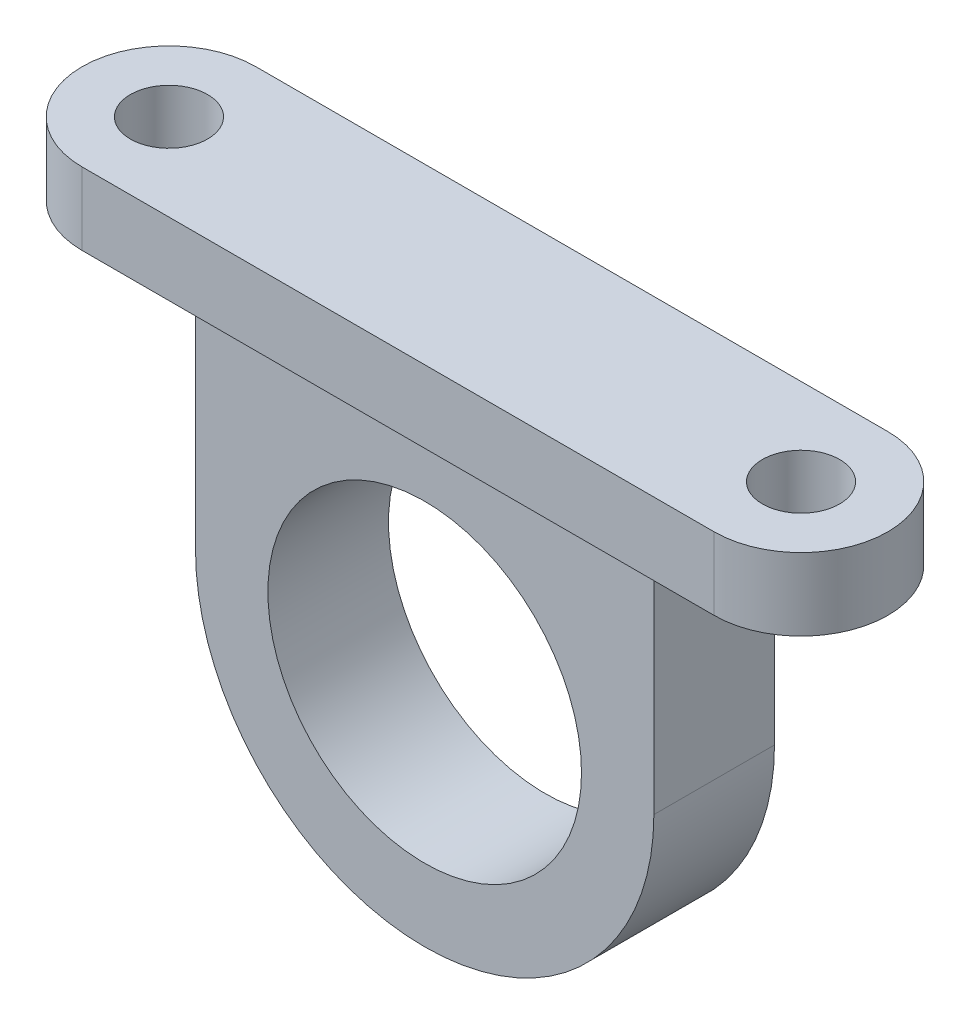
ISO-10303-21;
HEADER;
FILE_DESCRIPTION(('STEP AP214'),'2;1');
FILE_NAME('part.step','',(''),(''),'','','');
FILE_SCHEMA(('AUTOMOTIVE_DESIGN { 1 0 10303 214 1 1 1 1 }'));
ENDSEC;
DATA;
#1=APPLICATION_CONTEXT('core data for automotive mechanical design processes');
#2=APPLICATION_PROTOCOL_DEFINITION('international standard','automotive_design',2000,#1);
#3=PRODUCT_CONTEXT('',#1,'mechanical');
#4=PRODUCT('Part','Part','',(#3));
#5=PRODUCT_RELATED_PRODUCT_CATEGORY('part','',(#4));
#6=PRODUCT_DEFINITION_FORMATION('','',#4);
#7=PRODUCT_DEFINITION_CONTEXT('part definition',#1,'design');
#8=PRODUCT_DEFINITION('design','',#6,#7);
#9=PRODUCT_DEFINITION_SHAPE('','',#8);
#10=(LENGTH_UNIT() NAMED_UNIT(*) SI_UNIT(.MILLI.,.METRE.));
#11=(NAMED_UNIT(*) PLANE_ANGLE_UNIT() SI_UNIT($,.RADIAN.));
#12=(NAMED_UNIT(*) SI_UNIT($,.STERADIAN.) SOLID_ANGLE_UNIT());
#13=UNCERTAINTY_MEASURE_WITH_UNIT(LENGTH_MEASURE(1.E-05),#10,'distance_accuracy_value','');
#14=(GEOMETRIC_REPRESENTATION_CONTEXT(3) GLOBAL_UNCERTAINTY_ASSIGNED_CONTEXT((#13)) GLOBAL_UNIT_ASSIGNED_CONTEXT((#10,
#11,#12)) REPRESENTATION_CONTEXT('',''));
#15=CARTESIAN_POINT('',(0.,0.,0.));
#16=DIRECTION('',(0.,0.,1.));
#17=DIRECTION('',(1.,0.,0.));
#18=AXIS2_PLACEMENT_3D('',#15,#16,#17);
#19=CARTESIAN_POINT('',(0.,0.,5.));
#20=DIRECTION('',(0.,0.,1.));
#21=DIRECTION('',(1.,0.,0.));
#22=AXIS2_PLACEMENT_3D('',#19,#20,#21);
#23=PLANE('',#22);
#24=DIRECTION('',(-1.,0.,0.));
#25=VECTOR('',#24,1.);
#26=CARTESIAN_POINT('',(-9.5,9.5,5.));
#27=LINE('',#26,#25);
#28=CARTESIAN_POINT('',(9.5,9.5,5.));
#29=VERTEX_POINT('',#28);
#30=CARTESIAN_POINT('',(-9.5,9.5,5.));
#31=VERTEX_POINT('',#30);
#32=EDGE_CURVE('E201',#29,#31,#27,.T.);
#33=ORIENTED_EDGE('',*,*,#32,.T.);
#34=DIRECTION('',(0.,-1.,0.));
#35=VECTOR('',#34,1.);
#36=CARTESIAN_POINT('',(-9.5,0.,5.));
#37=LINE('',#36,#35);
#38=CARTESIAN_POINT('',(-9.5,0.,5.));
#39=VERTEX_POINT('',#38);
#40=EDGE_CURVE('E90',#31,#39,#37,.T.);
#41=ORIENTED_EDGE('',*,*,#40,.T.);
#42=CARTESIAN_POINT('',(0.,0.,5.));
#43=DIRECTION('',(0.,0.,1.));
#44=DIRECTION('',(1.,0.,0.));
#45=AXIS2_PLACEMENT_3D('',#42,#43,#44);
#46=CIRCLE('',#45,9.5);
#47=CARTESIAN_POINT('',(9.5,0.,5.));
#48=VERTEX_POINT('',#47);
#49=EDGE_CURVE('E207',#39,#48,#46,.T.);
#50=ORIENTED_EDGE('',*,*,#49,.T.);
#51=DIRECTION('',(0.,1.,0.));
#52=VECTOR('',#51,1.);
#53=CARTESIAN_POINT('',(9.5,0.,5.));
#54=LINE('',#53,#52);
#55=EDGE_CURVE('E65',#48,#29,#54,.T.);
#56=ORIENTED_EDGE('',*,*,#55,.T.);
#57=EDGE_LOOP('',(#33,#41,#50,#56));
#58=FACE_BOUND('',#57,.T.);
#59=CARTESIAN_POINT('',(0.,0.,5.));
#60=DIRECTION('',(0.,0.,1.));
#61=DIRECTION('',(1.,0.,0.));
#62=AXIS2_PLACEMENT_3D('',#59,#60,#61);
#63=CIRCLE('',#62,6.5);
#64=CARTESIAN_POINT('',(6.5,0.,5.));
#65=VERTEX_POINT('',#64);
#66=EDGE_CURVE('E193',#65,#65,#63,.T.);
#67=ORIENTED_EDGE('',*,*,#66,.F.);
#68=EDGE_LOOP('',(#67));
#69=FACE_BOUND('',#68,.T.);
#70=ADVANCED_FACE('F47',(#58,#69),#23,.T.);
#71=CARTESIAN_POINT('',(0.,0.,0.));
#72=DIRECTION('',(0.,0.,1.));
#73=DIRECTION('',(1.,0.,0.));
#74=AXIS2_PLACEMENT_3D('',#71,#72,#73);
#75=PLANE('',#74);
#76=DIRECTION('',(-1.,0.,0.));
#77=VECTOR('',#76,1.);
#78=CARTESIAN_POINT('',(-9.5,9.5,0.));
#79=LINE('',#78,#77);
#80=CARTESIAN_POINT('',(9.5,9.5,0.));
#81=VERTEX_POINT('',#80);
#82=CARTESIAN_POINT('',(-9.5,9.5,0.));
#83=VERTEX_POINT('',#82);
#84=EDGE_CURVE('E197',#81,#83,#79,.T.);
#85=ORIENTED_EDGE('',*,*,#84,.F.);
#86=DIRECTION('',(0.,1.,0.));
#87=VECTOR('',#86,1.);
#88=CARTESIAN_POINT('',(9.5,0.,0.));
#89=LINE('',#88,#87);
#90=CARTESIAN_POINT('',(9.5,0.,0.));
#91=VERTEX_POINT('',#90);
#92=EDGE_CURVE('E204',#91,#81,#89,.T.);
#93=ORIENTED_EDGE('',*,*,#92,.F.);
#94=CARTESIAN_POINT('',(0.,0.,0.));
#95=DIRECTION('',(0.,0.,1.));
#96=DIRECTION('',(1.,0.,0.));
#97=AXIS2_PLACEMENT_3D('',#94,#95,#96);
#98=CIRCLE('',#97,9.5);
#99=CARTESIAN_POINT('',(-9.5,0.,0.));
#100=VERTEX_POINT('',#99);
#101=EDGE_CURVE('E85',#100,#91,#98,.T.);
#102=ORIENTED_EDGE('',*,*,#101,.F.);
#103=DIRECTION('',(0.,-1.,0.));
#104=VECTOR('',#103,1.);
#105=CARTESIAN_POINT('',(-9.5,0.,0.));
#106=LINE('',#105,#104);
#107=EDGE_CURVE('E78',#83,#100,#106,.T.);
#108=ORIENTED_EDGE('',*,*,#107,.F.);
#109=EDGE_LOOP('',(#85,#93,#102,#108));
#110=FACE_BOUND('',#109,.T.);
#111=CARTESIAN_POINT('',(0.,0.,0.));
#112=DIRECTION('',(0.,0.,1.));
#113=DIRECTION('',(1.,0.,0.));
#114=AXIS2_PLACEMENT_3D('',#111,#112,#113);
#115=CIRCLE('',#114,6.5);
#116=CARTESIAN_POINT('',(6.5,0.,0.));
#117=VERTEX_POINT('',#116);
#118=EDGE_CURVE('E131',#117,#117,#115,.T.);
#119=ORIENTED_EDGE('',*,*,#118,.T.);
#120=EDGE_LOOP('',(#119));
#121=FACE_BOUND('',#120,.T.);
#122=ADVANCED_FACE('F233',(#110,#121),#75,.F.);
#123=CARTESIAN_POINT('',(-9.5,0.,5.));
#124=DIRECTION('',(1.,0.,0.));
#125=DIRECTION('',(0.,1.,0.));
#126=AXIS2_PLACEMENT_3D('',#123,#124,#125);
#127=PLANE('',#126);
#128=ORIENTED_EDGE('',*,*,#107,.T.);
#129=DIRECTION('',(0.,0.,-1.));
#130=VECTOR('',#129,1.);
#131=CARTESIAN_POINT('',(-9.5,0.,5.));
#132=LINE('',#131,#130);
#133=EDGE_CURVE('E57',#39,#100,#132,.T.);
#134=ORIENTED_EDGE('',*,*,#133,.F.);
#135=ORIENTED_EDGE('',*,*,#40,.F.);
#136=DIRECTION('',(0.,0.,-1.));
#137=VECTOR('',#136,1.);
#138=CARTESIAN_POINT('',(-9.5,9.5,5.));
#139=LINE('',#138,#137);
#140=EDGE_CURVE('E11',#31,#83,#139,.T.);
#141=ORIENTED_EDGE('',*,*,#140,.T.);
#142=EDGE_LOOP('',(#128,#134,#135,#141));
#143=FACE_BOUND('',#142,.T.);
#144=ADVANCED_FACE('F49',(#143),#127,.F.);
#145=CARTESIAN_POINT('',(0.,0.,5.));
#146=DIRECTION('',(0.,0.,-1.));
#147=DIRECTION('',(-1.,0.,0.));
#148=AXIS2_PLACEMENT_3D('',#145,#146,#147);
#149=CYLINDRICAL_SURFACE('',#148,9.5);
#150=ORIENTED_EDGE('',*,*,#101,.T.);
#151=DIRECTION('',(0.,0.,-1.));
#152=VECTOR('',#151,1.);
#153=CARTESIAN_POINT('',(9.5,0.,5.));
#154=LINE('',#153,#152);
#155=EDGE_CURVE('E226',#48,#91,#154,.T.);
#156=ORIENTED_EDGE('',*,*,#155,.F.);
#157=ORIENTED_EDGE('',*,*,#49,.F.);
#158=ORIENTED_EDGE('',*,*,#133,.T.);
#159=EDGE_LOOP('',(#150,#156,#157,#158));
#160=FACE_BOUND('',#159,.T.);
#161=ADVANCED_FACE('F230',(#160),#149,.T.);
#162=CARTESIAN_POINT('',(9.5,0.,5.));
#163=DIRECTION('',(-1.,0.,0.));
#164=DIRECTION('',(0.,-1.,0.));
#165=AXIS2_PLACEMENT_3D('',#162,#163,#164);
#166=PLANE('',#165);
#167=ORIENTED_EDGE('',*,*,#92,.T.);
#168=DIRECTION('',(0.,0.,-1.));
#169=VECTOR('',#168,1.);
#170=CARTESIAN_POINT('',(9.5,9.5,5.));
#171=LINE('',#170,#169);
#172=EDGE_CURVE('E212',#29,#81,#171,.T.);
#173=ORIENTED_EDGE('',*,*,#172,.F.);
#174=ORIENTED_EDGE('',*,*,#55,.F.);
#175=ORIENTED_EDGE('',*,*,#155,.T.);
#176=EDGE_LOOP('',(#167,#173,#174,#175));
#177=FACE_BOUND('',#176,.T.);
#178=ADVANCED_FACE('F236',(#177),#166,.F.);
#179=CARTESIAN_POINT('',(0.,0.,5.));
#180=DIRECTION('',(0.,0.,-1.));
#181=DIRECTION('',(-1.,0.,0.));
#182=AXIS2_PLACEMENT_3D('',#179,#180,#181);
#183=CYLINDRICAL_SURFACE('',#182,6.5);
#184=ORIENTED_EDGE('',*,*,#66,.T.);
#185=EDGE_LOOP('',(#184));
#186=FACE_BOUND('',#185,.T.);
#187=ORIENTED_EDGE('',*,*,#118,.F.);
#188=EDGE_LOOP('',(#187));
#189=FACE_BOUND('',#188,.T.);
#190=ADVANCED_FACE('F246',(#186,#189),#183,.F.);
#191=CARTESIAN_POINT('',(0.,9.5,0.));
#192=DIRECTION('',(0.,1.,0.));
#193=DIRECTION('',(0.,0.,1.));
#194=AXIS2_PLACEMENT_3D('',#191,#192,#193);
#195=PLANE('',#194);
#196=CARTESIAN_POINT('',(-13.1,9.5,2.5));
#197=DIRECTION('',(0.,1.,0.));
#198=DIRECTION('',(0.,0.,1.));
#199=AXIS2_PLACEMENT_3D('',#196,#197,#198);
#200=CIRCLE('',#199,1.6);
#201=CARTESIAN_POINT('',(-13.1,9.5,4.1));
#202=VERTEX_POINT('',#201);
#203=EDGE_CURVE('E165',#202,#202,#200,.T.);
#204=ORIENTED_EDGE('',*,*,#203,.T.);
#205=EDGE_LOOP('',(#204));
#206=FACE_BOUND('',#205,.T.);
#207=CARTESIAN_POINT('',(13.1,9.5,2.5));
#208=DIRECTION('',(0.,1.,0.));
#209=DIRECTION('',(0.,0.,1.));
#210=AXIS2_PLACEMENT_3D('',#207,#208,#209);
#211=CIRCLE('',#210,3.6);
#212=CARTESIAN_POINT('',(13.1,9.5,-1.1));
#213=VERTEX_POINT('',#212);
#214=CARTESIAN_POINT('',(13.1,9.5,6.1));
#215=VERTEX_POINT('',#214);
#216=EDGE_CURVE('E126',#213,#215,#211,.F.);
#217=ORIENTED_EDGE('',*,*,#216,.T.);
#218=DIRECTION('',(1.,0.,0.));
#219=VECTOR('',#218,1.);
#220=CARTESIAN_POINT('',(0.,9.5,6.1));
#221=LINE('',#220,#219);
#222=CARTESIAN_POINT('',(-13.1,9.5,6.1));
#223=VERTEX_POINT('',#222);
#224=EDGE_CURVE('E178',#223,#215,#221,.T.);
#225=ORIENTED_EDGE('',*,*,#224,.F.);
#226=CARTESIAN_POINT('',(-13.1,9.5,2.5));
#227=DIRECTION('',(0.,1.,0.));
#228=DIRECTION('',(0.,0.,1.));
#229=AXIS2_PLACEMENT_3D('',#226,#227,#228);
#230=CIRCLE('',#229,3.6);
#231=CARTESIAN_POINT('',(-13.1,9.5,-1.1));
#232=VERTEX_POINT('',#231);
#233=EDGE_CURVE('E174',#232,#223,#230,.T.);
#234=ORIENTED_EDGE('',*,*,#233,.F.);
#235=DIRECTION('',(-1.,0.,0.));
#236=VECTOR('',#235,1.);
#237=CARTESIAN_POINT('',(0.,9.5,-1.1));
#238=LINE('',#237,#236);
#239=EDGE_CURVE('E171',#213,#232,#238,.T.);
#240=ORIENTED_EDGE('',*,*,#239,.F.);
#241=EDGE_LOOP('',(#217,#225,#234,#240));
#242=FACE_BOUND('',#241,.T.);
#243=CARTESIAN_POINT('',(13.1,9.5,2.5));
#244=DIRECTION('',(0.,1.,0.));
#245=DIRECTION('',(0.,0.,1.));
#246=AXIS2_PLACEMENT_3D('',#243,#244,#245);
#247=CIRCLE('',#246,1.6);
#248=CARTESIAN_POINT('',(13.1,9.5,4.1));
#249=VERTEX_POINT('',#248);
#250=EDGE_CURVE('E153',#249,#249,#247,.F.);
#251=ORIENTED_EDGE('',*,*,#250,.F.);
#252=EDGE_LOOP('',(#251));
#253=FACE_BOUND('',#252,.T.);
#254=ORIENTED_EDGE('',*,*,#172,.T.);
#255=ORIENTED_EDGE('',*,*,#84,.T.);
#256=ORIENTED_EDGE('',*,*,#140,.F.);
#257=ORIENTED_EDGE('',*,*,#32,.F.);
#258=EDGE_LOOP('',(#254,#255,#256,#257));
#259=FACE_BOUND('',#258,.T.);
#260=ADVANCED_FACE('F239',(#206,#242,#253,#259),#195,.F.);
#261=CARTESIAN_POINT('',(13.1,12.5,2.5));
#262=DIRECTION('',(0.,-1.,0.));
#263=DIRECTION('',(0.,0.,-1.));
#264=AXIS2_PLACEMENT_3D('',#261,#262,#263);
#265=CYLINDRICAL_SURFACE('',#264,3.6);
#266=ORIENTED_EDGE('',*,*,#216,.F.);
#267=DIRECTION('',(0.,-1.,0.));
#268=VECTOR('',#267,1.);
#269=CARTESIAN_POINT('',(13.1,12.5,-1.1));
#270=LINE('',#269,#268);
#271=CARTESIAN_POINT('',(13.1,12.5,-1.1));
#272=VERTEX_POINT('',#271);
#273=EDGE_CURVE('E120',#272,#213,#270,.T.);
#274=ORIENTED_EDGE('',*,*,#273,.F.);
#275=CARTESIAN_POINT('',(13.1,12.5,2.5));
#276=DIRECTION('',(0.,1.,0.));
#277=DIRECTION('',(0.,0.,1.));
#278=AXIS2_PLACEMENT_3D('',#275,#276,#277);
#279=CIRCLE('',#278,3.6);
#280=CARTESIAN_POINT('',(13.1,12.5,6.1));
#281=VERTEX_POINT('',#280);
#282=EDGE_CURVE('E124',#272,#281,#279,.F.);
#283=ORIENTED_EDGE('',*,*,#282,.T.);
#284=DIRECTION('',(0.,-1.,0.));
#285=VECTOR('',#284,1.);
#286=CARTESIAN_POINT('',(13.1,12.5,6.1));
#287=LINE('',#286,#285);
#288=EDGE_CURVE('E164',#281,#215,#287,.T.);
#289=ORIENTED_EDGE('',*,*,#288,.T.);
#290=EDGE_LOOP('',(#266,#274,#283,#289));
#291=FACE_BOUND('',#290,.T.);
#292=ADVANCED_FACE('F122',(#291),#265,.T.);
#293=CARTESIAN_POINT('',(0.,12.5,-1.1));
#294=DIRECTION('',(0.,0.,1.));
#295=DIRECTION('',(1.,0.,0.));
#296=AXIS2_PLACEMENT_3D('',#293,#294,#295);
#297=PLANE('',#296);
#298=ORIENTED_EDGE('',*,*,#239,.T.);
#299=DIRECTION('',(0.,-1.,0.));
#300=VECTOR('',#299,1.);
#301=CARTESIAN_POINT('',(-13.1,12.5,-1.1));
#302=LINE('',#301,#300);
#303=CARTESIAN_POINT('',(-13.1,12.5,-1.1));
#304=VERTEX_POINT('',#303);
#305=EDGE_CURVE('E132',#304,#232,#302,.T.);
#306=ORIENTED_EDGE('',*,*,#305,.F.);
#307=DIRECTION('',(-1.,0.,0.));
#308=VECTOR('',#307,1.);
#309=CARTESIAN_POINT('',(0.,12.5,-1.1));
#310=LINE('',#309,#308);
#311=EDGE_CURVE('E136',#272,#304,#310,.T.);
#312=ORIENTED_EDGE('',*,*,#311,.F.);
#313=ORIENTED_EDGE('',*,*,#273,.T.);
#314=EDGE_LOOP('',(#298,#306,#312,#313));
#315=FACE_BOUND('',#314,.T.);
#316=ADVANCED_FACE('F137',(#315),#297,.F.);
#317=CARTESIAN_POINT('',(-13.1,12.5,2.5));
#318=DIRECTION('',(0.,-1.,0.));
#319=DIRECTION('',(0.,0.,-1.));
#320=AXIS2_PLACEMENT_3D('',#317,#318,#319);
#321=CYLINDRICAL_SURFACE('',#320,3.6);
#322=ORIENTED_EDGE('',*,*,#233,.T.);
#323=DIRECTION('',(0.,-1.,0.));
#324=VECTOR('',#323,1.);
#325=CARTESIAN_POINT('',(-13.1,12.5,6.1));
#326=LINE('',#325,#324);
#327=CARTESIAN_POINT('',(-13.1,12.5,6.1));
#328=VERTEX_POINT('',#327);
#329=EDGE_CURVE('E187',#328,#223,#326,.T.);
#330=ORIENTED_EDGE('',*,*,#329,.F.);
#331=CARTESIAN_POINT('',(-13.1,12.5,2.5));
#332=DIRECTION('',(0.,1.,0.));
#333=DIRECTION('',(0.,0.,1.));
#334=AXIS2_PLACEMENT_3D('',#331,#332,#333);
#335=CIRCLE('',#334,3.6);
#336=EDGE_CURVE('E142',#304,#328,#335,.T.);
#337=ORIENTED_EDGE('',*,*,#336,.F.);
#338=ORIENTED_EDGE('',*,*,#305,.T.);
#339=EDGE_LOOP('',(#322,#330,#337,#338));
#340=FACE_BOUND('',#339,.T.);
#341=ADVANCED_FACE('F310',(#340),#321,.T.);
#342=CARTESIAN_POINT('',(0.,12.5,6.1));
#343=DIRECTION('',(0.,0.,-1.));
#344=DIRECTION('',(-1.,0.,0.));
#345=AXIS2_PLACEMENT_3D('',#342,#343,#344);
#346=PLANE('',#345);
#347=ORIENTED_EDGE('',*,*,#224,.T.);
#348=ORIENTED_EDGE('',*,*,#288,.F.);
#349=DIRECTION('',(1.,0.,0.));
#350=VECTOR('',#349,1.);
#351=CARTESIAN_POINT('',(0.,12.5,6.1));
#352=LINE('',#351,#350);
#353=EDGE_CURVE('E146',#328,#281,#352,.T.);
#354=ORIENTED_EDGE('',*,*,#353,.F.);
#355=ORIENTED_EDGE('',*,*,#329,.T.);
#356=EDGE_LOOP('',(#347,#348,#354,#355));
#357=FACE_BOUND('',#356,.T.);
#358=ADVANCED_FACE('F318',(#357),#346,.F.);
#359=CARTESIAN_POINT('',(-13.1,12.5,2.5));
#360=DIRECTION('',(0.,-1.,0.));
#361=DIRECTION('',(0.,0.,-1.));
#362=AXIS2_PLACEMENT_3D('',#359,#360,#361);
#363=CYLINDRICAL_SURFACE('',#362,1.6);
#364=CARTESIAN_POINT('',(-13.1,12.5,2.5));
#365=DIRECTION('',(0.,1.,0.));
#366=DIRECTION('',(0.,0.,1.));
#367=AXIS2_PLACEMENT_3D('',#364,#365,#366);
#368=CIRCLE('',#367,1.6);
#369=CARTESIAN_POINT('',(-13.1,12.5,4.1));
#370=VERTEX_POINT('',#369);
#371=EDGE_CURVE('E149',#370,#370,#368,.T.);
#372=ORIENTED_EDGE('',*,*,#371,.T.);
#373=EDGE_LOOP('',(#372));
#374=FACE_BOUND('',#373,.T.);
#375=ORIENTED_EDGE('',*,*,#203,.F.);
#376=EDGE_LOOP('',(#375));
#377=FACE_BOUND('',#376,.T.);
#378=ADVANCED_FACE('F327',(#374,#377),#363,.F.);
#379=CARTESIAN_POINT('',(13.1,12.5,2.5));
#380=DIRECTION('',(0.,-1.,0.));
#381=DIRECTION('',(0.,0.,-1.));
#382=AXIS2_PLACEMENT_3D('',#379,#380,#381);
#383=CYLINDRICAL_SURFACE('',#382,1.6);
#384=CARTESIAN_POINT('',(13.1,12.5,2.5));
#385=DIRECTION('',(0.,1.,0.));
#386=DIRECTION('',(0.,0.,1.));
#387=AXIS2_PLACEMENT_3D('',#384,#385,#386);
#388=CIRCLE('',#387,1.6);
#389=CARTESIAN_POINT('',(13.1,12.5,4.1));
#390=VERTEX_POINT('',#389);
#391=EDGE_CURVE('E160',#390,#390,#388,.F.);
#392=ORIENTED_EDGE('',*,*,#391,.F.);
#393=EDGE_LOOP('',(#392));
#394=FACE_BOUND('',#393,.T.);
#395=ORIENTED_EDGE('',*,*,#250,.T.);
#396=EDGE_LOOP('',(#395));
#397=FACE_BOUND('',#396,.T.);
#398=ADVANCED_FACE('F336',(#394,#397),#383,.F.);
#399=CARTESIAN_POINT('',(0.,12.5,0.));
#400=DIRECTION('',(0.,1.,0.));
#401=DIRECTION('',(0.,0.,1.));
#402=AXIS2_PLACEMENT_3D('',#399,#400,#401);
#403=PLANE('',#402);
#404=ORIENTED_EDGE('',*,*,#371,.F.);
#405=EDGE_LOOP('',(#404));
#406=FACE_BOUND('',#405,.T.);
#407=ORIENTED_EDGE('',*,*,#282,.F.);
#408=ORIENTED_EDGE('',*,*,#311,.T.);
#409=ORIENTED_EDGE('',*,*,#336,.T.);
#410=ORIENTED_EDGE('',*,*,#353,.T.);
#411=EDGE_LOOP('',(#407,#408,#409,#410));
#412=FACE_BOUND('',#411,.T.);
#413=ORIENTED_EDGE('',*,*,#391,.T.);
#414=EDGE_LOOP('',(#413));
#415=FACE_BOUND('',#414,.T.);
#416=ADVANCED_FACE('F144',(#406,#412,#415),#403,.T.);
#417=CLOSED_SHELL('',(#70,#122,#144,#161,#178,#190,#260,#292,#316,#341,#358,#378,#398,#416));
#418=MANIFOLD_SOLID_BREP('B2',#417);
#419=ADVANCED_BREP_SHAPE_REPRESENTATION('',(#18,#418),#14);
#420=SHAPE_DEFINITION_REPRESENTATION(#9,#419);
ENDSEC;
END-ISO-10303-21;
